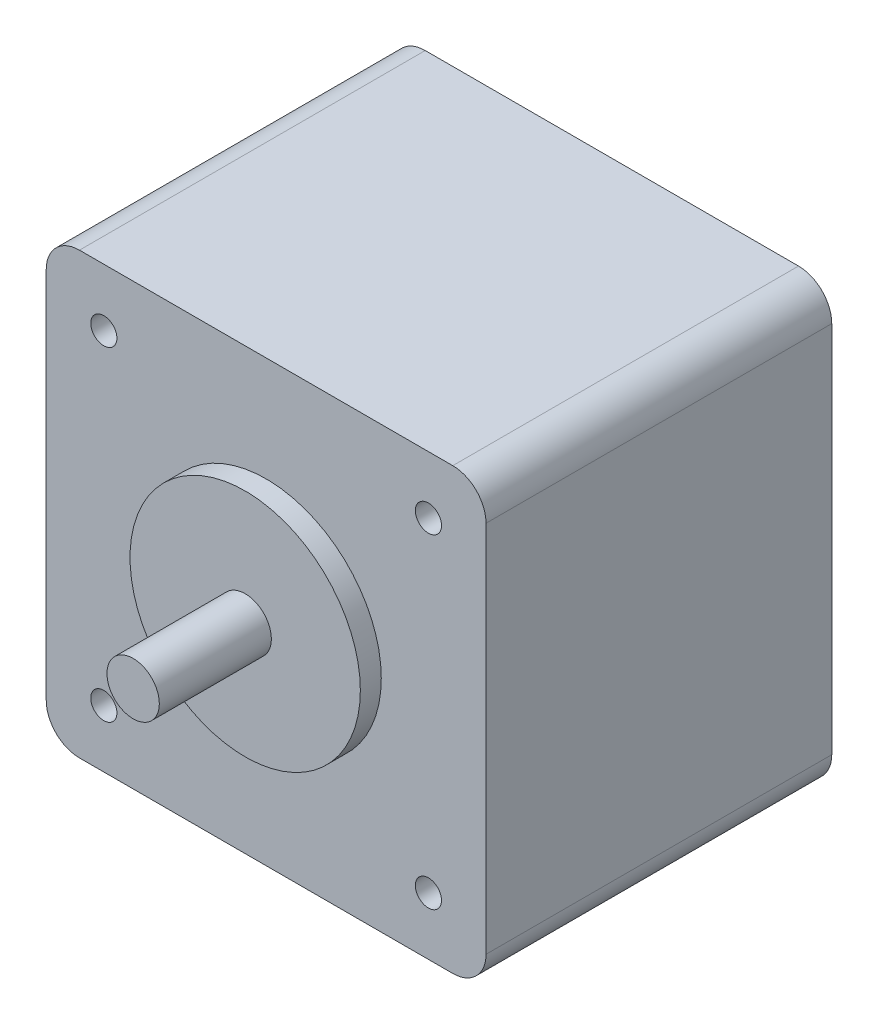
ISO-10303-21;
HEADER;
FILE_DESCRIPTION(('STEP AP214'),'2;1');
FILE_NAME('part.step','',(''),(''),'','','');
FILE_SCHEMA(('AUTOMOTIVE_DESIGN { 1 0 10303 214 1 1 1 1 }'));
ENDSEC;
DATA;
#1=APPLICATION_CONTEXT('core data for automotive mechanical design processes');
#2=APPLICATION_PROTOCOL_DEFINITION('international standard','automotive_design',2000,#1);
#3=PRODUCT_CONTEXT('',#1,'mechanical');
#4=PRODUCT('Part','Part','',(#3));
#5=PRODUCT_RELATED_PRODUCT_CATEGORY('part','',(#4));
#6=PRODUCT_DEFINITION_FORMATION('','',#4);
#7=PRODUCT_DEFINITION_CONTEXT('part definition',#1,'design');
#8=PRODUCT_DEFINITION('design','',#6,#7);
#9=PRODUCT_DEFINITION_SHAPE('','',#8);
#10=(LENGTH_UNIT() NAMED_UNIT(*) SI_UNIT(.MILLI.,.METRE.));
#11=(NAMED_UNIT(*) PLANE_ANGLE_UNIT() SI_UNIT($,.RADIAN.));
#12=(NAMED_UNIT(*) SI_UNIT($,.STERADIAN.) SOLID_ANGLE_UNIT());
#13=UNCERTAINTY_MEASURE_WITH_UNIT(LENGTH_MEASURE(1.E-05),#10,'distance_accuracy_value','');
#14=(GEOMETRIC_REPRESENTATION_CONTEXT(3) GLOBAL_UNCERTAINTY_ASSIGNED_CONTEXT((#13)) GLOBAL_UNIT_ASSIGNED_CONTEXT((#10,
#11,#12)) REPRESENTATION_CONTEXT('',''));
#15=CARTESIAN_POINT('',(0.,0.,0.));
#16=DIRECTION('',(0.,0.,1.));
#17=DIRECTION('',(1.,0.,0.));
#18=AXIS2_PLACEMENT_3D('',#15,#16,#17);
#19=CARTESIAN_POINT('',(-21.,-21.,0.));
#20=DIRECTION('',(0.,-1.,0.));
#21=DIRECTION('',(0.,0.,-1.));
#22=AXIS2_PLACEMENT_3D('',#19,#20,#21);
#23=PLANE('',#22);
#24=DIRECTION('',(1.,0.,0.));
#25=VECTOR('',#24,1.);
#26=CARTESIAN_POINT('',(-21.,-21.,33.02));
#27=LINE('',#26,#25);
#28=CARTESIAN_POINT('',(-17.825,-21.,33.02));
#29=VERTEX_POINT('',#28);
#30=CARTESIAN_POINT('',(17.825,-21.,33.02));
#31=VERTEX_POINT('',#30);
#32=EDGE_CURVE('E152',#29,#31,#27,.T.);
#33=ORIENTED_EDGE('',*,*,#32,.F.);
#34=DIRECTION('',(0.,0.,1.));
#35=VECTOR('',#34,1.);
#36=CARTESIAN_POINT('',(-17.825,-21.,0.));
#37=LINE('',#36,#35);
#38=CARTESIAN_POINT('',(-17.825,-21.,0.));
#39=VERTEX_POINT('',#38);
#40=EDGE_CURVE('E11',#29,#39,#37,.F.);
#41=ORIENTED_EDGE('',*,*,#40,.T.);
#42=DIRECTION('',(1.,0.,0.));
#43=VECTOR('',#42,1.);
#44=CARTESIAN_POINT('',(-21.,-21.,0.));
#45=LINE('',#44,#43);
#46=CARTESIAN_POINT('',(17.825,-21.,0.));
#47=VERTEX_POINT('',#46);
#48=EDGE_CURVE('E153',#39,#47,#45,.T.);
#49=ORIENTED_EDGE('',*,*,#48,.T.);
#50=DIRECTION('',(0.,0.,1.));
#51=VECTOR('',#50,1.);
#52=CARTESIAN_POINT('',(17.825,-21.,0.));
#53=LINE('',#52,#51);
#54=EDGE_CURVE('E42',#47,#31,#53,.T.);
#55=ORIENTED_EDGE('',*,*,#54,.T.);
#56=EDGE_LOOP('',(#33,#41,#49,#55));
#57=FACE_BOUND('',#56,.T.);
#58=ADVANCED_FACE('F34',(#57),#23,.T.);
#59=CARTESIAN_POINT('',(-21.,21.,0.));
#60=DIRECTION('',(-1.,0.,0.));
#61=DIRECTION('',(0.,-1.,0.));
#62=AXIS2_PLACEMENT_3D('',#59,#60,#61);
#63=PLANE('',#62);
#64=DIRECTION('',(0.,-1.,0.));
#65=VECTOR('',#64,1.);
#66=CARTESIAN_POINT('',(-21.,21.,33.02));
#67=LINE('',#66,#65);
#68=CARTESIAN_POINT('',(-21.,17.825,33.02));
#69=VERTEX_POINT('',#68);
#70=CARTESIAN_POINT('',(-21.,-17.825,33.02));
#71=VERTEX_POINT('',#70);
#72=EDGE_CURVE('E157',#69,#71,#67,.T.);
#73=ORIENTED_EDGE('',*,*,#72,.F.);
#74=DIRECTION('',(0.,0.,1.));
#75=VECTOR('',#74,1.);
#76=CARTESIAN_POINT('',(-21.,17.825,0.));
#77=LINE('',#76,#75);
#78=CARTESIAN_POINT('',(-21.,17.825,0.));
#79=VERTEX_POINT('',#78);
#80=EDGE_CURVE('E194',#69,#79,#77,.F.);
#81=ORIENTED_EDGE('',*,*,#80,.T.);
#82=DIRECTION('',(0.,-1.,0.));
#83=VECTOR('',#82,1.);
#84=CARTESIAN_POINT('',(-21.,21.,0.));
#85=LINE('',#84,#83);
#86=CARTESIAN_POINT('',(-21.,-17.825,0.));
#87=VERTEX_POINT('',#86);
#88=EDGE_CURVE('E162',#79,#87,#85,.T.);
#89=ORIENTED_EDGE('',*,*,#88,.T.);
#90=DIRECTION('',(0.,0.,1.));
#91=VECTOR('',#90,1.);
#92=CARTESIAN_POINT('',(-21.,-17.825,0.));
#93=LINE('',#92,#91);
#94=EDGE_CURVE('E191',#87,#71,#93,.T.);
#95=ORIENTED_EDGE('',*,*,#94,.T.);
#96=EDGE_LOOP('',(#73,#81,#89,#95));
#97=FACE_BOUND('',#96,.T.);
#98=ADVANCED_FACE('F222',(#97),#63,.T.);
#99=CARTESIAN_POINT('',(21.,21.,0.));
#100=DIRECTION('',(0.,1.,0.));
#101=DIRECTION('',(-1.,0.,0.));
#102=AXIS2_PLACEMENT_3D('',#99,#100,#101);
#103=PLANE('',#102);
#104=DIRECTION('',(-1.,0.,0.));
#105=VECTOR('',#104,1.);
#106=CARTESIAN_POINT('',(21.,21.,0.));
#107=LINE('',#106,#105);
#108=CARTESIAN_POINT('',(17.825,21.,0.));
#109=VERTEX_POINT('',#108);
#110=CARTESIAN_POINT('',(-17.825,21.,0.));
#111=VERTEX_POINT('',#110);
#112=EDGE_CURVE('E159',#109,#111,#107,.T.);
#113=ORIENTED_EDGE('',*,*,#112,.T.);
#114=DIRECTION('',(0.,0.,1.));
#115=VECTOR('',#114,1.);
#116=CARTESIAN_POINT('',(-17.825,21.,0.));
#117=LINE('',#116,#115);
#118=CARTESIAN_POINT('',(-17.825,21.,33.02));
#119=VERTEX_POINT('',#118);
#120=EDGE_CURVE('E180',#111,#119,#117,.T.);
#121=ORIENTED_EDGE('',*,*,#120,.T.);
#122=DIRECTION('',(-1.,0.,0.));
#123=VECTOR('',#122,1.);
#124=CARTESIAN_POINT('',(21.,21.,33.02));
#125=LINE('',#124,#123);
#126=CARTESIAN_POINT('',(17.825,21.,33.02));
#127=VERTEX_POINT('',#126);
#128=EDGE_CURVE('E171',#127,#119,#125,.T.);
#129=ORIENTED_EDGE('',*,*,#128,.F.);
#130=DIRECTION('',(0.,0.,1.));
#131=VECTOR('',#130,1.);
#132=CARTESIAN_POINT('',(17.825,21.,0.));
#133=LINE('',#132,#131);
#134=EDGE_CURVE('E178',#127,#109,#133,.F.);
#135=ORIENTED_EDGE('',*,*,#134,.T.);
#136=EDGE_LOOP('',(#113,#121,#129,#135));
#137=FACE_BOUND('',#136,.T.);
#138=ADVANCED_FACE('F232',(#137),#103,.T.);
#139=CARTESIAN_POINT('',(21.,-21.,0.));
#140=DIRECTION('',(1.,0.,0.));
#141=DIRECTION('',(0.,1.,0.));
#142=AXIS2_PLACEMENT_3D('',#139,#140,#141);
#143=PLANE('',#142);
#144=DIRECTION('',(0.,1.,0.));
#145=VECTOR('',#144,1.);
#146=CARTESIAN_POINT('',(21.,-21.,0.));
#147=LINE('',#146,#145);
#148=CARTESIAN_POINT('',(21.,-17.825,0.));
#149=VERTEX_POINT('',#148);
#150=CARTESIAN_POINT('',(21.,17.825,0.));
#151=VERTEX_POINT('',#150);
#152=EDGE_CURVE('E156',#149,#151,#147,.T.);
#153=ORIENTED_EDGE('',*,*,#152,.T.);
#154=DIRECTION('',(0.,0.,1.));
#155=VECTOR('',#154,1.);
#156=CARTESIAN_POINT('',(21.,17.825,0.));
#157=LINE('',#156,#155);
#158=CARTESIAN_POINT('',(21.,17.825,33.02));
#159=VERTEX_POINT('',#158);
#160=EDGE_CURVE('E204',#151,#159,#157,.T.);
#161=ORIENTED_EDGE('',*,*,#160,.T.);
#162=DIRECTION('',(0.,1.,0.));
#163=VECTOR('',#162,1.);
#164=CARTESIAN_POINT('',(21.,-21.,33.02));
#165=LINE('',#164,#163);
#166=CARTESIAN_POINT('',(21.,-17.825,33.02));
#167=VERTEX_POINT('',#166);
#168=EDGE_CURVE('E168',#167,#159,#165,.T.);
#169=ORIENTED_EDGE('',*,*,#168,.F.);
#170=DIRECTION('',(0.,0.,1.));
#171=VECTOR('',#170,1.);
#172=CARTESIAN_POINT('',(21.,-17.825,0.));
#173=LINE('',#172,#171);
#174=EDGE_CURVE('E56',#167,#149,#173,.F.);
#175=ORIENTED_EDGE('',*,*,#174,.T.);
#176=EDGE_LOOP('',(#153,#161,#169,#175));
#177=FACE_BOUND('',#176,.T.);
#178=ADVANCED_FACE('F237',(#177),#143,.T.);
#179=CARTESIAN_POINT('',(21.,-21.,0.));
#180=DIRECTION('',(0.,0.,1.));
#181=DIRECTION('',(1.,0.,0.));
#182=AXIS2_PLACEMENT_3D('',#179,#180,#181);
#183=PLANE('',#182);
#184=ORIENTED_EDGE('',*,*,#88,.F.);
#185=CARTESIAN_POINT('',(-17.825,17.825,0.));
#186=DIRECTION('',(0.,0.,1.));
#187=DIRECTION('',(1.,0.,0.));
#188=AXIS2_PLACEMENT_3D('',#185,#186,#187);
#189=CIRCLE('',#188,3.175);
#190=EDGE_CURVE('E201',#79,#111,#189,.F.);
#191=ORIENTED_EDGE('',*,*,#190,.T.);
#192=ORIENTED_EDGE('',*,*,#112,.F.);
#193=CARTESIAN_POINT('',(17.825,17.825,0.));
#194=DIRECTION('',(0.,0.,1.));
#195=DIRECTION('',(1.,0.,0.));
#196=AXIS2_PLACEMENT_3D('',#193,#194,#195);
#197=CIRCLE('',#196,3.175);
#198=EDGE_CURVE('E49',#109,#151,#197,.F.);
#199=ORIENTED_EDGE('',*,*,#198,.T.);
#200=ORIENTED_EDGE('',*,*,#152,.F.);
#201=CARTESIAN_POINT('',(17.825,-17.825,0.));
#202=DIRECTION('',(0.,0.,1.));
#203=DIRECTION('',(1.,0.,0.));
#204=AXIS2_PLACEMENT_3D('',#201,#202,#203);
#205=CIRCLE('',#204,3.175);
#206=EDGE_CURVE('E196',#149,#47,#205,.F.);
#207=ORIENTED_EDGE('',*,*,#206,.T.);
#208=ORIENTED_EDGE('',*,*,#48,.F.);
#209=CARTESIAN_POINT('',(-17.825,-17.825,0.));
#210=DIRECTION('',(0.,0.,1.));
#211=DIRECTION('',(1.,0.,0.));
#212=AXIS2_PLACEMENT_3D('',#209,#210,#211);
#213=CIRCLE('',#212,3.175);
#214=EDGE_CURVE('E198',#39,#87,#213,.F.);
#215=ORIENTED_EDGE('',*,*,#214,.T.);
#216=EDGE_LOOP('',(#184,#191,#192,#199,#200,#207,#208,#215));
#217=FACE_BOUND('',#216,.T.);
#218=ADVANCED_FACE('F226',(#217),#183,.F.);
#219=CARTESIAN_POINT('',(21.,-21.,33.02));
#220=DIRECTION('',(0.,0.,1.));
#221=DIRECTION('',(1.,0.,0.));
#222=AXIS2_PLACEMENT_3D('',#219,#220,#221);
#223=PLANE('',#222);
#224=CARTESIAN_POINT('',(-15.5,15.5,33.02));
#225=DIRECTION('',(0.,0.,1.));
#226=DIRECTION('',(1.,0.,0.));
#227=AXIS2_PLACEMENT_3D('',#224,#225,#226);
#228=CIRCLE('',#227,1.25);
#229=CARTESIAN_POINT('',(-14.25,15.5,33.02));
#230=VERTEX_POINT('',#229);
#231=EDGE_CURVE('E121',#230,#230,#228,.T.);
#232=ORIENTED_EDGE('',*,*,#231,.F.);
#233=EDGE_LOOP('',(#232));
#234=FACE_BOUND('',#233,.T.);
#235=CARTESIAN_POINT('',(-15.4999999999996,-15.5,33.02));
#236=DIRECTION('',(0.,0.,1.));
#237=DIRECTION('',(1.,0.,0.));
#238=AXIS2_PLACEMENT_3D('',#235,#236,#237);
#239=CIRCLE('',#238,1.25);
#240=CARTESIAN_POINT('',(-14.2499999999996,-15.5,33.02));
#241=VERTEX_POINT('',#240);
#242=EDGE_CURVE('E120',#241,#241,#239,.T.);
#243=ORIENTED_EDGE('',*,*,#242,.F.);
#244=EDGE_LOOP('',(#243));
#245=FACE_BOUND('',#244,.T.);
#246=CARTESIAN_POINT('',(15.5000000000004,-15.4999999999996,33.02));
#247=DIRECTION('',(0.,0.,1.));
#248=DIRECTION('',(1.,0.,0.));
#249=AXIS2_PLACEMENT_3D('',#246,#247,#248);
#250=CIRCLE('',#249,1.25);
#251=CARTESIAN_POINT('',(16.7500000000004,-15.4999999999996,33.02));
#252=VERTEX_POINT('',#251);
#253=EDGE_CURVE('E131',#252,#252,#250,.T.);
#254=ORIENTED_EDGE('',*,*,#253,.F.);
#255=EDGE_LOOP('',(#254));
#256=FACE_BOUND('',#255,.T.);
#257=CARTESIAN_POINT('',(15.4999999999998,15.5000000000002,33.02));
#258=DIRECTION('',(0.,0.,1.));
#259=DIRECTION('',(1.,0.,0.));
#260=AXIS2_PLACEMENT_3D('',#257,#258,#259);
#261=CIRCLE('',#260,1.25);
#262=CARTESIAN_POINT('',(16.7499999999998,15.5000000000002,33.02));
#263=VERTEX_POINT('',#262);
#264=EDGE_CURVE('E137',#263,#263,#261,.T.);
#265=ORIENTED_EDGE('',*,*,#264,.F.);
#266=EDGE_LOOP('',(#265));
#267=FACE_BOUND('',#266,.T.);
#268=CARTESIAN_POINT('',(0.,0.,33.02));
#269=DIRECTION('',(0.,0.,1.));
#270=DIRECTION('',(1.,0.,0.));
#271=AXIS2_PLACEMENT_3D('',#268,#269,#270);
#272=CIRCLE('',#271,10.9982);
#273=CARTESIAN_POINT('',(10.9982,0.,33.02));
#274=VERTEX_POINT('',#273);
#275=EDGE_CURVE('E165',#274,#274,#272,.T.);
#276=ORIENTED_EDGE('',*,*,#275,.F.);
#277=EDGE_LOOP('',(#276));
#278=FACE_BOUND('',#277,.T.);
#279=ORIENTED_EDGE('',*,*,#128,.T.);
#280=CARTESIAN_POINT('',(-17.825,17.825,33.02));
#281=DIRECTION('',(0.,0.,1.));
#282=DIRECTION('',(1.,0.,0.));
#283=AXIS2_PLACEMENT_3D('',#280,#281,#282);
#284=CIRCLE('',#283,3.175);
#285=EDGE_CURVE('E189',#119,#69,#284,.T.);
#286=ORIENTED_EDGE('',*,*,#285,.T.);
#287=ORIENTED_EDGE('',*,*,#72,.T.);
#288=CARTESIAN_POINT('',(-17.825,-17.825,33.02));
#289=DIRECTION('',(0.,0.,1.));
#290=DIRECTION('',(1.,0.,0.));
#291=AXIS2_PLACEMENT_3D('',#288,#289,#290);
#292=CIRCLE('',#291,3.175);
#293=EDGE_CURVE('E185',#71,#29,#292,.T.);
#294=ORIENTED_EDGE('',*,*,#293,.T.);
#295=ORIENTED_EDGE('',*,*,#32,.T.);
#296=CARTESIAN_POINT('',(17.825,-17.825,33.02));
#297=DIRECTION('',(0.,0.,1.));
#298=DIRECTION('',(1.,0.,0.));
#299=AXIS2_PLACEMENT_3D('',#296,#297,#298);
#300=CIRCLE('',#299,3.175);
#301=EDGE_CURVE('E183',#31,#167,#300,.T.);
#302=ORIENTED_EDGE('',*,*,#301,.T.);
#303=ORIENTED_EDGE('',*,*,#168,.T.);
#304=CARTESIAN_POINT('',(17.825,17.825,33.02));
#305=DIRECTION('',(0.,0.,1.));
#306=DIRECTION('',(1.,0.,0.));
#307=AXIS2_PLACEMENT_3D('',#304,#305,#306);
#308=CIRCLE('',#307,3.175);
#309=EDGE_CURVE('E187',#159,#127,#308,.T.);
#310=ORIENTED_EDGE('',*,*,#309,.T.);
#311=EDGE_LOOP('',(#279,#286,#287,#294,#295,#302,#303,#310));
#312=FACE_BOUND('',#311,.T.);
#313=ADVANCED_FACE('F215',(#234,#245,#256,#267,#278,#312),#223,.T.);
#314=CARTESIAN_POINT('',(0.,0.,33.02));
#315=DIRECTION('',(0.,0.,1.));
#316=DIRECTION('',(1.,0.,0.));
#317=AXIS2_PLACEMENT_3D('',#314,#315,#316);
#318=CYLINDRICAL_SURFACE('',#317,10.9982);
#319=ORIENTED_EDGE('',*,*,#275,.T.);
#320=EDGE_LOOP('',(#319));
#321=FACE_BOUND('',#320,.T.);
#322=CARTESIAN_POINT('',(0.,0.,35.02));
#323=DIRECTION('',(0.,0.,1.));
#324=DIRECTION('',(1.,0.,0.));
#325=AXIS2_PLACEMENT_3D('',#322,#323,#324);
#326=CIRCLE('',#325,10.9982);
#327=CARTESIAN_POINT('',(10.9982,0.,35.02));
#328=VERTEX_POINT('',#327);
#329=EDGE_CURVE('E143',#328,#328,#326,.T.);
#330=ORIENTED_EDGE('',*,*,#329,.F.);
#331=EDGE_LOOP('',(#330));
#332=FACE_BOUND('',#331,.T.);
#333=ADVANCED_FACE('F377',(#321,#332),#318,.T.);
#334=CARTESIAN_POINT('',(0.,0.,45.72));
#335=DIRECTION('',(0.,0.,1.));
#336=DIRECTION('',(1.,0.,0.));
#337=AXIS2_PLACEMENT_3D('',#334,#335,#336);
#338=PLANE('',#337);
#339=CARTESIAN_POINT('',(0.,0.,45.72));
#340=DIRECTION('',(0.,0.,1.));
#341=DIRECTION('',(1.,0.,0.));
#342=AXIS2_PLACEMENT_3D('',#339,#340,#341);
#343=CIRCLE('',#342,2.5);
#344=CARTESIAN_POINT('',(2.5,0.,45.72));
#345=VERTEX_POINT('',#344);
#346=EDGE_CURVE('E149',#345,#345,#343,.T.);
#347=ORIENTED_EDGE('',*,*,#346,.T.);
#348=EDGE_LOOP('',(#347));
#349=FACE_BOUND('',#348,.T.);
#350=ADVANCED_FACE('F368',(#349),#338,.T.);
#351=CARTESIAN_POINT('',(0.,0.,33.02));
#352=DIRECTION('',(0.,0.,1.));
#353=DIRECTION('',(1.,0.,0.));
#354=AXIS2_PLACEMENT_3D('',#351,#352,#353);
#355=CYLINDRICAL_SURFACE('',#354,2.5);
#356=CARTESIAN_POINT('',(0.,0.,35.02));
#357=DIRECTION('',(0.,0.,1.));
#358=DIRECTION('',(1.,0.,0.));
#359=AXIS2_PLACEMENT_3D('',#356,#357,#358);
#360=CIRCLE('',#359,2.5);
#361=CARTESIAN_POINT('',(2.5,0.,35.02));
#362=VERTEX_POINT('',#361);
#363=EDGE_CURVE('E146',#362,#362,#360,.T.);
#364=ORIENTED_EDGE('',*,*,#363,.T.);
#365=EDGE_LOOP('',(#364));
#366=FACE_BOUND('',#365,.T.);
#367=ORIENTED_EDGE('',*,*,#346,.F.);
#368=EDGE_LOOP('',(#367));
#369=FACE_BOUND('',#368,.T.);
#370=ADVANCED_FACE('F358',(#366,#369),#355,.T.);
#371=CARTESIAN_POINT('',(2.5,0.,35.02));
#372=DIRECTION('',(0.,0.,1.));
#373=DIRECTION('',(1.,0.,0.));
#374=AXIS2_PLACEMENT_3D('',#371,#372,#373);
#375=PLANE('',#374);
#376=ORIENTED_EDGE('',*,*,#329,.T.);
#377=EDGE_LOOP('',(#376));
#378=FACE_BOUND('',#377,.T.);
#379=ORIENTED_EDGE('',*,*,#363,.F.);
#380=EDGE_LOOP('',(#379));
#381=FACE_BOUND('',#380,.T.);
#382=ADVANCED_FACE('F349',(#378,#381),#375,.T.);
#383=CARTESIAN_POINT('',(15.4999999999998,15.5000000000002,25.52));
#384=DIRECTION('',(0.,0.,1.));
#385=DIRECTION('',(1.,0.,0.));
#386=AXIS2_PLACEMENT_3D('',#383,#384,#385);
#387=CONICAL_SURFACE('',#386,1.25,1.02974425867665);
#388=CARTESIAN_POINT('',(15.4999999999998,15.5000000000002,24.7689242262156));
#389=VERTEX_POINT('',#388);
#390=VERTEX_LOOP('',#389);
#391=FACE_BOUND('',#390,.T.);
#392=CARTESIAN_POINT('',(15.4999999999998,15.5000000000002,25.52));
#393=DIRECTION('',(0.,0.,1.));
#394=DIRECTION('',(1.,0.,0.));
#395=AXIS2_PLACEMENT_3D('',#392,#393,#394);
#396=CIRCLE('',#395,1.25);
#397=CARTESIAN_POINT('',(16.7499999999998,15.5000000000002,25.52));
#398=VERTEX_POINT('',#397);
#399=EDGE_CURVE('E140',#398,#398,#396,.T.);
#400=ORIENTED_EDGE('',*,*,#399,.T.);
#401=EDGE_LOOP('',(#400));
#402=FACE_BOUND('',#401,.T.);
#403=ADVANCED_FACE('F340',(#391,#402),#387,.F.);
#404=CARTESIAN_POINT('',(15.4999999999998,15.5000000000002,33.02));
#405=DIRECTION('',(0.,0.,1.));
#406=DIRECTION('',(1.,0.,0.));
#407=AXIS2_PLACEMENT_3D('',#404,#405,#406);
#408=CYLINDRICAL_SURFACE('',#407,1.25);
#409=ORIENTED_EDGE('',*,*,#399,.F.);
#410=EDGE_LOOP('',(#409));
#411=FACE_BOUND('',#410,.T.);
#412=ORIENTED_EDGE('',*,*,#264,.T.);
#413=EDGE_LOOP('',(#412));
#414=FACE_BOUND('',#413,.T.);
#415=ADVANCED_FACE('F331',(#411,#414),#408,.F.);
#416=CARTESIAN_POINT('',(15.5000000000004,-15.4999999999996,25.52));
#417=DIRECTION('',(0.,0.,1.));
#418=DIRECTION('',(1.,0.,0.));
#419=AXIS2_PLACEMENT_3D('',#416,#417,#418);
#420=CONICAL_SURFACE('',#419,1.25,1.02974425867665);
#421=CARTESIAN_POINT('',(15.5000000000004,-15.4999999999996,24.7689242262156));
#422=VERTEX_POINT('',#421);
#423=VERTEX_LOOP('',#422);
#424=FACE_BOUND('',#423,.T.);
#425=CARTESIAN_POINT('',(15.5000000000004,-15.4999999999996,25.52));
#426=DIRECTION('',(0.,0.,1.));
#427=DIRECTION('',(1.,0.,0.));
#428=AXIS2_PLACEMENT_3D('',#425,#426,#427);
#429=CIRCLE('',#428,1.25);
#430=CARTESIAN_POINT('',(16.7500000000004,-15.4999999999996,25.52));
#431=VERTEX_POINT('',#430);
#432=EDGE_CURVE('E134',#431,#431,#429,.T.);
#433=ORIENTED_EDGE('',*,*,#432,.T.);
#434=EDGE_LOOP('',(#433));
#435=FACE_BOUND('',#434,.T.);
#436=ADVANCED_FACE('F322',(#424,#435),#420,.F.);
#437=CARTESIAN_POINT('',(15.5000000000004,-15.4999999999996,33.02));
#438=DIRECTION('',(0.,0.,1.));
#439=DIRECTION('',(1.,0.,0.));
#440=AXIS2_PLACEMENT_3D('',#437,#438,#439);
#441=CYLINDRICAL_SURFACE('',#440,1.25);
#442=ORIENTED_EDGE('',*,*,#432,.F.);
#443=EDGE_LOOP('',(#442));
#444=FACE_BOUND('',#443,.T.);
#445=ORIENTED_EDGE('',*,*,#253,.T.);
#446=EDGE_LOOP('',(#445));
#447=FACE_BOUND('',#446,.T.);
#448=ADVANCED_FACE('F313',(#444,#447),#441,.F.);
#449=CARTESIAN_POINT('',(-15.4999999999996,-15.5,25.52));
#450=DIRECTION('',(0.,0.,1.));
#451=DIRECTION('',(1.,0.,0.));
#452=AXIS2_PLACEMENT_3D('',#449,#450,#451);
#453=CONICAL_SURFACE('',#452,1.25,1.02974425867665);
#454=CARTESIAN_POINT('',(-15.4999999999996,-15.5,24.7689242262156));
#455=VERTEX_POINT('',#454);
#456=VERTEX_LOOP('',#455);
#457=FACE_BOUND('',#456,.T.);
#458=CARTESIAN_POINT('',(-15.4999999999996,-15.5,25.52));
#459=DIRECTION('',(0.,0.,1.));
#460=DIRECTION('',(1.,0.,0.));
#461=AXIS2_PLACEMENT_3D('',#458,#459,#460);
#462=CIRCLE('',#461,1.25);
#463=CARTESIAN_POINT('',(-14.2499999999996,-15.5,25.52));
#464=VERTEX_POINT('',#463);
#465=EDGE_CURVE('E124',#464,#464,#462,.T.);
#466=ORIENTED_EDGE('',*,*,#465,.T.);
#467=EDGE_LOOP('',(#466));
#468=FACE_BOUND('',#467,.T.);
#469=ADVANCED_FACE('F304',(#457,#468),#453,.F.);
#470=CARTESIAN_POINT('',(-15.4999999999996,-15.5,33.02));
#471=DIRECTION('',(0.,0.,1.));
#472=DIRECTION('',(1.,0.,0.));
#473=AXIS2_PLACEMENT_3D('',#470,#471,#472);
#474=CYLINDRICAL_SURFACE('',#473,1.25);
#475=ORIENTED_EDGE('',*,*,#465,.F.);
#476=EDGE_LOOP('',(#475));
#477=FACE_BOUND('',#476,.T.);
#478=ORIENTED_EDGE('',*,*,#242,.T.);
#479=EDGE_LOOP('',(#478));
#480=FACE_BOUND('',#479,.T.);
#481=ADVANCED_FACE('F114',(#477,#480),#474,.F.);
#482=CARTESIAN_POINT('',(-15.5,15.5,25.52));
#483=DIRECTION('',(0.,0.,1.));
#484=DIRECTION('',(1.,0.,0.));
#485=AXIS2_PLACEMENT_3D('',#482,#483,#484);
#486=CONICAL_SURFACE('',#485,1.25,1.02974425867665);
#487=CARTESIAN_POINT('',(-15.5,15.5,24.7689242262156));
#488=VERTEX_POINT('',#487);
#489=VERTEX_LOOP('',#488);
#490=FACE_BOUND('',#489,.T.);
#491=CARTESIAN_POINT('',(-15.5,15.5,25.52));
#492=DIRECTION('',(0.,0.,1.));
#493=DIRECTION('',(1.,0.,0.));
#494=AXIS2_PLACEMENT_3D('',#491,#492,#493);
#495=CIRCLE('',#494,1.25);
#496=CARTESIAN_POINT('',(-14.25,15.5,25.52));
#497=VERTEX_POINT('',#496);
#498=EDGE_CURVE('E118',#497,#497,#495,.T.);
#499=ORIENTED_EDGE('',*,*,#498,.T.);
#500=EDGE_LOOP('',(#499));
#501=FACE_BOUND('',#500,.T.);
#502=ADVANCED_FACE('F110',(#490,#501),#486,.F.);
#503=CARTESIAN_POINT('',(-15.5,15.5,33.02));
#504=DIRECTION('',(0.,0.,1.));
#505=DIRECTION('',(1.,0.,0.));
#506=AXIS2_PLACEMENT_3D('',#503,#504,#505);
#507=CYLINDRICAL_SURFACE('',#506,1.25);
#508=ORIENTED_EDGE('',*,*,#498,.F.);
#509=EDGE_LOOP('',(#508));
#510=FACE_BOUND('',#509,.T.);
#511=ORIENTED_EDGE('',*,*,#231,.T.);
#512=EDGE_LOOP('',(#511));
#513=FACE_BOUND('',#512,.T.);
#514=ADVANCED_FACE('F113',(#510,#513),#507,.F.);
#515=CARTESIAN_POINT('',(-17.825,17.825,0.));
#516=DIRECTION('',(0.,0.,1.));
#517=DIRECTION('',(1.,0.,0.));
#518=AXIS2_PLACEMENT_3D('',#515,#516,#517);
#519=CYLINDRICAL_SURFACE('',#518,3.175);
#520=ORIENTED_EDGE('',*,*,#190,.F.);
#521=ORIENTED_EDGE('',*,*,#80,.F.);
#522=ORIENTED_EDGE('',*,*,#285,.F.);
#523=ORIENTED_EDGE('',*,*,#120,.F.);
#524=EDGE_LOOP('',(#520,#521,#522,#523));
#525=FACE_BOUND('',#524,.T.);
#526=ADVANCED_FACE('F229',(#525),#519,.T.);
#527=CARTESIAN_POINT('',(17.825,17.825,0.));
#528=DIRECTION('',(0.,0.,1.));
#529=DIRECTION('',(1.,0.,0.));
#530=AXIS2_PLACEMENT_3D('',#527,#528,#529);
#531=CYLINDRICAL_SURFACE('',#530,3.175);
#532=ORIENTED_EDGE('',*,*,#198,.F.);
#533=ORIENTED_EDGE('',*,*,#134,.F.);
#534=ORIENTED_EDGE('',*,*,#309,.F.);
#535=ORIENTED_EDGE('',*,*,#160,.F.);
#536=EDGE_LOOP('',(#532,#533,#534,#535));
#537=FACE_BOUND('',#536,.T.);
#538=ADVANCED_FACE('F236',(#537),#531,.T.);
#539=CARTESIAN_POINT('',(-17.825,-17.825,0.));
#540=DIRECTION('',(0.,0.,1.));
#541=DIRECTION('',(1.,0.,0.));
#542=AXIS2_PLACEMENT_3D('',#539,#540,#541);
#543=CYLINDRICAL_SURFACE('',#542,3.175);
#544=ORIENTED_EDGE('',*,*,#214,.F.);
#545=ORIENTED_EDGE('',*,*,#40,.F.);
#546=ORIENTED_EDGE('',*,*,#293,.F.);
#547=ORIENTED_EDGE('',*,*,#94,.F.);
#548=EDGE_LOOP('',(#544,#545,#546,#547));
#549=FACE_BOUND('',#548,.T.);
#550=ADVANCED_FACE('F220',(#549),#543,.T.);
#551=CARTESIAN_POINT('',(17.825,-17.825,0.));
#552=DIRECTION('',(0.,0.,1.));
#553=DIRECTION('',(1.,0.,0.));
#554=AXIS2_PLACEMENT_3D('',#551,#552,#553);
#555=CYLINDRICAL_SURFACE('',#554,3.175);
#556=ORIENTED_EDGE('',*,*,#206,.F.);
#557=ORIENTED_EDGE('',*,*,#174,.F.);
#558=ORIENTED_EDGE('',*,*,#301,.F.);
#559=ORIENTED_EDGE('',*,*,#54,.F.);
#560=EDGE_LOOP('',(#556,#557,#558,#559));
#561=FACE_BOUND('',#560,.T.);
#562=ADVANCED_FACE('F36',(#561),#555,.T.);
#563=CLOSED_SHELL('',(#58,#98,#138,#178,#218,#313,#333,#350,#370,#382,#403,#415,#436,#448,#469,
#481,#502,#514,#526,#538,#550,#562));
#564=MANIFOLD_SOLID_BREP('B2',#563);
#565=ADVANCED_BREP_SHAPE_REPRESENTATION('',(#18,#564),#14);
#566=SHAPE_DEFINITION_REPRESENTATION(#9,#565);
ENDSEC;
END-ISO-10303-21;
